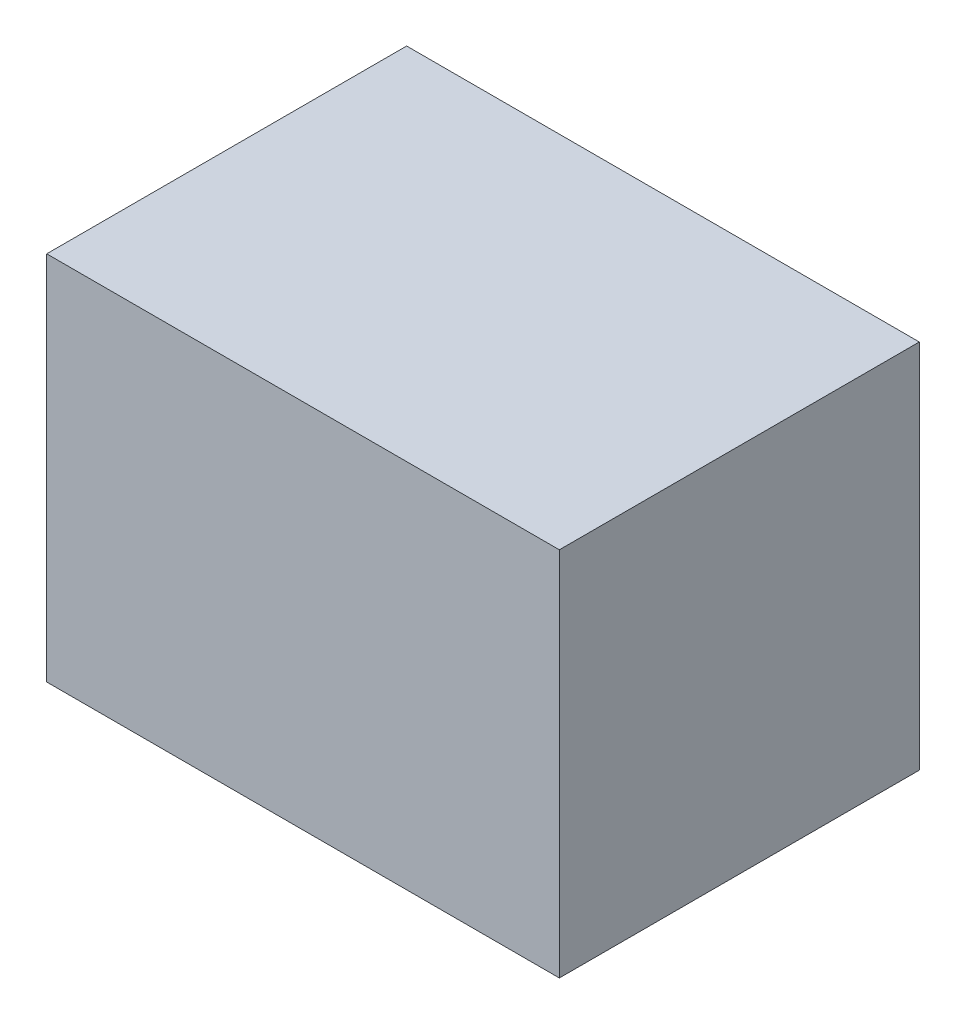
ISO-10303-21;
HEADER;
FILE_DESCRIPTION(('STEP AP214'),'2;1');
FILE_NAME('part.step','',(''),(''),'','','');
FILE_SCHEMA(('AUTOMOTIVE_DESIGN { 1 0 10303 214 1 1 1 1 }'));
ENDSEC;
DATA;
#1=APPLICATION_CONTEXT('core data for automotive mechanical design processes');
#2=APPLICATION_PROTOCOL_DEFINITION('international standard','automotive_design',2000,#1);
#3=PRODUCT_CONTEXT('',#1,'mechanical');
#4=PRODUCT('Part','Part','',(#3));
#5=PRODUCT_RELATED_PRODUCT_CATEGORY('part','',(#4));
#6=PRODUCT_DEFINITION_FORMATION('','',#4);
#7=PRODUCT_DEFINITION_CONTEXT('part definition',#1,'design');
#8=PRODUCT_DEFINITION('design','',#6,#7);
#9=PRODUCT_DEFINITION_SHAPE('','',#8);
#10=(LENGTH_UNIT() NAMED_UNIT(*) SI_UNIT(.MILLI.,.METRE.));
#11=(NAMED_UNIT(*) PLANE_ANGLE_UNIT() SI_UNIT($,.RADIAN.));
#12=(NAMED_UNIT(*) SI_UNIT($,.STERADIAN.) SOLID_ANGLE_UNIT());
#13=UNCERTAINTY_MEASURE_WITH_UNIT(LENGTH_MEASURE(1.E-05),#10,'distance_accuracy_value','');
#14=(GEOMETRIC_REPRESENTATION_CONTEXT(3) GLOBAL_UNCERTAINTY_ASSIGNED_CONTEXT((#13)) GLOBAL_UNIT_ASSIGNED_CONTEXT((#10,
#11,#12)) REPRESENTATION_CONTEXT('',''));
#15=CARTESIAN_POINT('',(0.,0.,0.));
#16=DIRECTION('',(0.,0.,1.));
#17=DIRECTION('',(1.,0.,0.));
#18=AXIS2_PLACEMENT_3D('',#15,#16,#17);
#19=CARTESIAN_POINT('',(-0.00781250000000001,3.4,-1.71875));
#20=DIRECTION('',(1.,0.,0.));
#21=DIRECTION('',(0.,0.,-1.));
#22=AXIS2_PLACEMENT_3D('',#19,#20,#21);
#23=PLANE('',#22);
#24=DIRECTION('',(0.,0.,1.));
#25=VECTOR('',#24,1.);
#26=CARTESIAN_POINT('',(-0.00781250000000001,0.,-1.71875));
#27=LINE('',#26,#25);
#28=CARTESIAN_POINT('',(-0.00781250000000001,0.,-1.71875));
#29=VERTEX_POINT('',#28);
#30=CARTESIAN_POINT('',(-0.00781249999999914,0.,1.58125));
#31=VERTEX_POINT('',#30);
#32=EDGE_CURVE('E96',#29,#31,#27,.T.);
#33=ORIENTED_EDGE('',*,*,#32,.T.);
#34=DIRECTION('',(0.,-1.,0.));
#35=VECTOR('',#34,1.);
#36=CARTESIAN_POINT('',(-0.00781249999999914,3.4,1.58125));
#37=LINE('',#36,#35);
#38=CARTESIAN_POINT('',(-0.00781249999999914,3.4,1.58125));
#39=VERTEX_POINT('',#38);
#40=EDGE_CURVE('E11',#39,#31,#37,.T.);
#41=ORIENTED_EDGE('',*,*,#40,.F.);
#42=DIRECTION('',(0.,0.,1.));
#43=VECTOR('',#42,1.);
#44=CARTESIAN_POINT('',(-0.00781250000000001,3.4,-1.71875));
#45=LINE('',#44,#43);
#46=CARTESIAN_POINT('',(-0.00781250000000001,3.4,-1.71875));
#47=VERTEX_POINT('',#46);
#48=EDGE_CURVE('E84',#47,#39,#45,.T.);
#49=ORIENTED_EDGE('',*,*,#48,.F.);
#50=DIRECTION('',(0.,-1.,0.));
#51=VECTOR('',#50,1.);
#52=CARTESIAN_POINT('',(-0.00781250000000001,3.4,-1.71875));
#53=LINE('',#52,#51);
#54=EDGE_CURVE('E92',#47,#29,#53,.T.);
#55=ORIENTED_EDGE('',*,*,#54,.T.);
#56=EDGE_LOOP('',(#33,#41,#49,#55));
#57=FACE_BOUND('',#56,.T.);
#58=ADVANCED_FACE('F33',(#57),#23,.F.);
#59=CARTESIAN_POINT('',(-0.00781249999999914,3.4,1.58125));
#60=DIRECTION('',(0.,0.,-1.));
#61=DIRECTION('',(-1.,0.,0.));
#62=AXIS2_PLACEMENT_3D('',#59,#60,#61);
#63=PLANE('',#62);
#64=DIRECTION('',(1.,0.,0.));
#65=VECTOR('',#64,1.);
#66=CARTESIAN_POINT('',(-0.00781249999999914,0.,1.58125));
#67=LINE('',#66,#65);
#68=CARTESIAN_POINT('',(4.6921875,0.,1.58125));
#69=VERTEX_POINT('',#68);
#70=EDGE_CURVE('E88',#31,#69,#67,.T.);
#71=ORIENTED_EDGE('',*,*,#70,.T.);
#72=DIRECTION('',(0.,-1.,0.));
#73=VECTOR('',#72,1.);
#74=CARTESIAN_POINT('',(4.6921875,3.4,1.58125));
#75=LINE('',#74,#73);
#76=CARTESIAN_POINT('',(4.6921875,3.4,1.58125));
#77=VERTEX_POINT('',#76);
#78=EDGE_CURVE('E41',#77,#69,#75,.T.);
#79=ORIENTED_EDGE('',*,*,#78,.F.);
#80=DIRECTION('',(1.,0.,0.));
#81=VECTOR('',#80,1.);
#82=CARTESIAN_POINT('',(-0.00781249999999914,3.4,1.58125));
#83=LINE('',#82,#81);
#84=EDGE_CURVE('E79',#39,#77,#83,.T.);
#85=ORIENTED_EDGE('',*,*,#84,.F.);
#86=ORIENTED_EDGE('',*,*,#40,.T.);
#87=EDGE_LOOP('',(#71,#79,#85,#86));
#88=FACE_BOUND('',#87,.T.);
#89=ADVANCED_FACE('F87',(#88),#63,.F.);
#90=CARTESIAN_POINT('',(4.6921875,3.4,-1.71875));
#91=DIRECTION('',(-1.,0.,0.));
#92=DIRECTION('',(0.,0.,1.));
#93=AXIS2_PLACEMENT_3D('',#90,#91,#92);
#94=PLANE('',#93);
#95=DIRECTION('',(0.,0.,-1.));
#96=VECTOR('',#95,1.);
#97=CARTESIAN_POINT('',(4.6921875,0.,-1.71875));
#98=LINE('',#97,#96);
#99=CARTESIAN_POINT('',(4.6921875,0.,-1.71875));
#100=VERTEX_POINT('',#99);
#101=EDGE_CURVE('E66',#69,#100,#98,.T.);
#102=ORIENTED_EDGE('',*,*,#101,.T.);
#103=DIRECTION('',(0.,-1.,0.));
#104=VECTOR('',#103,1.);
#105=CARTESIAN_POINT('',(4.6921875,3.4,-1.71875));
#106=LINE('',#105,#104);
#107=CARTESIAN_POINT('',(4.6921875,3.4,-1.71875));
#108=VERTEX_POINT('',#107);
#109=EDGE_CURVE('E89',#108,#100,#106,.T.);
#110=ORIENTED_EDGE('',*,*,#109,.F.);
#111=DIRECTION('',(0.,0.,-1.));
#112=VECTOR('',#111,1.);
#113=CARTESIAN_POINT('',(4.6921875,3.4,-1.71875));
#114=LINE('',#113,#112);
#115=EDGE_CURVE('E82',#77,#108,#114,.T.);
#116=ORIENTED_EDGE('',*,*,#115,.F.);
#117=ORIENTED_EDGE('',*,*,#78,.T.);
#118=EDGE_LOOP('',(#102,#110,#116,#117));
#119=FACE_BOUND('',#118,.T.);
#120=ADVANCED_FACE('F90',(#119),#94,.F.);
#121=CARTESIAN_POINT('',(-0.00781250000000001,3.4,-1.71875));
#122=DIRECTION('',(0.,0.,1.));
#123=DIRECTION('',(1.,0.,0.));
#124=AXIS2_PLACEMENT_3D('',#121,#122,#123);
#125=PLANE('',#124);
#126=DIRECTION('',(-1.,0.,0.));
#127=VECTOR('',#126,1.);
#128=CARTESIAN_POINT('',(-0.00781250000000001,0.,-1.71875));
#129=LINE('',#128,#127);
#130=EDGE_CURVE('E72',#100,#29,#129,.T.);
#131=ORIENTED_EDGE('',*,*,#130,.T.);
#132=ORIENTED_EDGE('',*,*,#54,.F.);
#133=DIRECTION('',(-1.,0.,0.));
#134=VECTOR('',#133,1.);
#135=CARTESIAN_POINT('',(-0.00781250000000001,3.4,-1.71875));
#136=LINE('',#135,#134);
#137=EDGE_CURVE('E49',#108,#47,#136,.T.);
#138=ORIENTED_EDGE('',*,*,#137,.F.);
#139=ORIENTED_EDGE('',*,*,#109,.T.);
#140=EDGE_LOOP('',(#131,#132,#138,#139));
#141=FACE_BOUND('',#140,.T.);
#142=ADVANCED_FACE('F103',(#141),#125,.F.);
#143=CARTESIAN_POINT('',(0.,3.4,0.));
#144=DIRECTION('',(0.,1.,0.));
#145=DIRECTION('',(0.,0.,1.));
#146=AXIS2_PLACEMENT_3D('',#143,#144,#145);
#147=PLANE('',#146);
#148=ORIENTED_EDGE('',*,*,#48,.T.);
#149=ORIENTED_EDGE('',*,*,#84,.T.);
#150=ORIENTED_EDGE('',*,*,#115,.T.);
#151=ORIENTED_EDGE('',*,*,#137,.T.);
#152=EDGE_LOOP('',(#148,#149,#150,#151));
#153=FACE_BOUND('',#152,.T.);
#154=ADVANCED_FACE('F80',(#153),#147,.T.);
#155=CARTESIAN_POINT('',(0.,0.,0.));
#156=DIRECTION('',(0.,1.,0.));
#157=DIRECTION('',(0.,0.,1.));
#158=AXIS2_PLACEMENT_3D('',#155,#156,#157);
#159=PLANE('',#158);
#160=ORIENTED_EDGE('',*,*,#32,.F.);
#161=ORIENTED_EDGE('',*,*,#130,.F.);
#162=ORIENTED_EDGE('',*,*,#101,.F.);
#163=ORIENTED_EDGE('',*,*,#70,.F.);
#164=EDGE_LOOP('',(#160,#161,#162,#163));
#165=FACE_BOUND('',#164,.T.);
#166=ADVANCED_FACE('F106',(#165),#159,.F.);
#167=CLOSED_SHELL('',(#58,#89,#120,#142,#154,#166));
#168=MANIFOLD_SOLID_BREP('B2',#167);
#169=ADVANCED_BREP_SHAPE_REPRESENTATION('',(#18,#168),#14);
#170=SHAPE_DEFINITION_REPRESENTATION(#9,#169);
ENDSEC;
END-ISO-10303-21;
